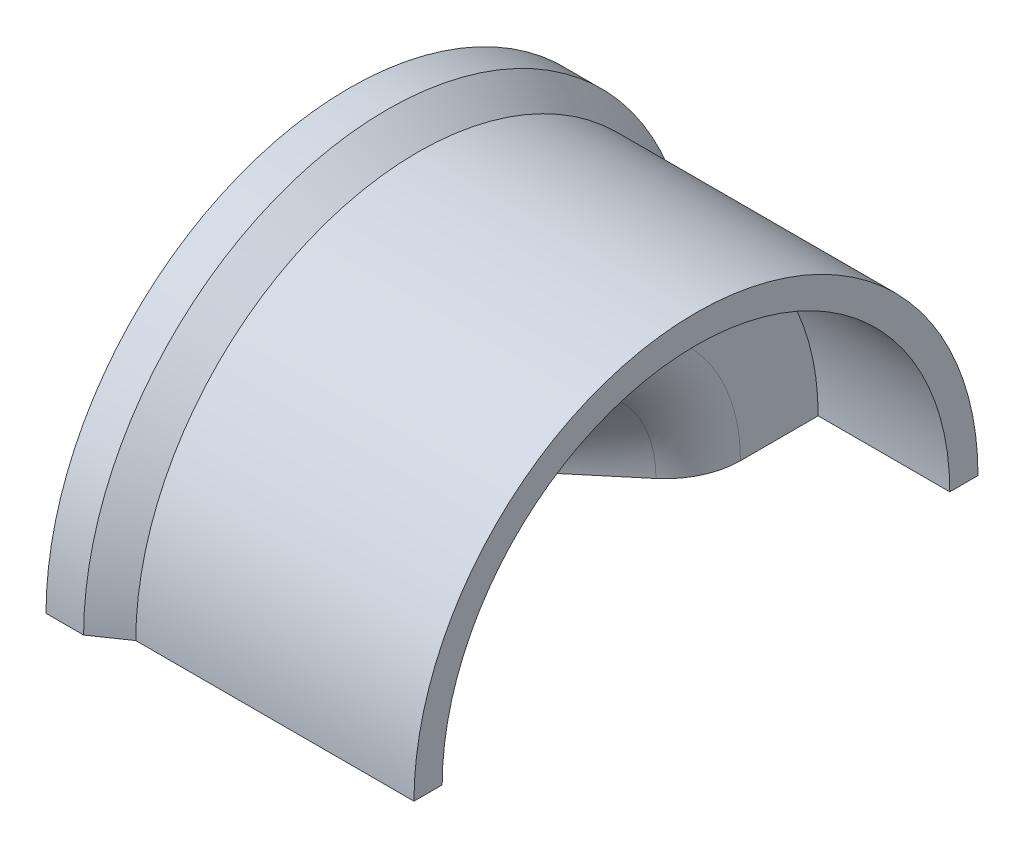
ISO-10303-21;
HEADER;
FILE_DESCRIPTION(('STEP AP214'),'2;1');
FILE_NAME('part.step','',(''),(''),'','','');
FILE_SCHEMA(('AUTOMOTIVE_DESIGN { 1 0 10303 214 1 1 1 1 }'));
ENDSEC;
DATA;
#1=APPLICATION_CONTEXT('core data for automotive mechanical design processes');
#2=APPLICATION_PROTOCOL_DEFINITION('international standard','automotive_design',2000,#1);
#3=PRODUCT_CONTEXT('',#1,'mechanical');
#4=PRODUCT('Part','Part','',(#3));
#5=PRODUCT_RELATED_PRODUCT_CATEGORY('part','',(#4));
#6=PRODUCT_DEFINITION_FORMATION('','',#4);
#7=PRODUCT_DEFINITION_CONTEXT('part definition',#1,'design');
#8=PRODUCT_DEFINITION('design','',#6,#7);
#9=PRODUCT_DEFINITION_SHAPE('','',#8);
#10=(LENGTH_UNIT() NAMED_UNIT(*) SI_UNIT(.MILLI.,.METRE.));
#11=(NAMED_UNIT(*) PLANE_ANGLE_UNIT() SI_UNIT($,.RADIAN.));
#12=(NAMED_UNIT(*) SI_UNIT($,.STERADIAN.) SOLID_ANGLE_UNIT());
#13=UNCERTAINTY_MEASURE_WITH_UNIT(LENGTH_MEASURE(1.E-05),#10,'distance_accuracy_value','');
#14=(GEOMETRIC_REPRESENTATION_CONTEXT(3) GLOBAL_UNCERTAINTY_ASSIGNED_CONTEXT((#13)) GLOBAL_UNIT_ASSIGNED_CONTEXT((#10,
#11,#12)) REPRESENTATION_CONTEXT('',''));
#15=CARTESIAN_POINT('',(0.,0.,0.));
#16=DIRECTION('',(0.,0.,1.));
#17=DIRECTION('',(1.,0.,0.));
#18=AXIS2_PLACEMENT_3D('',#15,#16,#17);
#19=CARTESIAN_POINT('',(31.9094287112631,0.,0.));
#20=DIRECTION('',(-1.,0.,0.));
#21=DIRECTION('',(0.,0.,1.));
#22=AXIS2_PLACEMENT_3D('',#19,#20,#21);
#23=CONICAL_SURFACE('',#22,13.9812828009221,0.602952512155745);
#24=CARTESIAN_POINT('',(24.5472437075883,0.,0.));
#25=DIRECTION('',(-1.,0.,0.));
#26=DIRECTION('',(0.,0.,1.));
#27=AXIS2_PLACEMENT_3D('',#24,#25,#26);
#28=CIRCLE('',#27,19.05);
#29=CARTESIAN_POINT('',(24.5472437075883,0.,-19.05));
#30=VERTEX_POINT('',#29);
#31=CARTESIAN_POINT('',(24.5472437075883,0.,19.05));
#32=VERTEX_POINT('',#31);
#33=EDGE_CURVE('E137',#30,#32,#28,.F.);
#34=ORIENTED_EDGE('',*,*,#33,.F.);
#35=DIRECTION('',(-0.823664906207426,0.,-0.567076822205168));
#36=VECTOR('',#35,1.);
#37=CARTESIAN_POINT('',(52.216892419795,0.,0.));
#38=LINE('',#37,#36);
#39=CARTESIAN_POINT('',(22.460516588814,0.,-20.4866699059361));
#40=VERTEX_POINT('',#39);
#41=EDGE_CURVE('E130',#30,#40,#38,.T.);
#42=ORIENTED_EDGE('',*,*,#41,.T.);
#43=CARTESIAN_POINT('',(22.460516588814,0.,0.));
#44=DIRECTION('',(-1.,0.,0.));
#45=DIRECTION('',(0.,0.,1.));
#46=AXIS2_PLACEMENT_3D('',#43,#44,#45);
#47=CIRCLE('',#46,20.4866699059361);
#48=CARTESIAN_POINT('',(22.460516588814,0.,20.4866699059361));
#49=VERTEX_POINT('',#48);
#50=EDGE_CURVE('E129',#49,#40,#47,.T.);
#51=ORIENTED_EDGE('',*,*,#50,.F.);
#52=DIRECTION('',(0.823664906207426,0.,-0.567076822205168));
#53=VECTOR('',#52,1.);
#54=CARTESIAN_POINT('',(52.216892419795,0.,0.));
#55=LINE('',#54,#53);
#56=EDGE_CURVE('E164',#49,#32,#55,.T.);
#57=ORIENTED_EDGE('',*,*,#56,.T.);
#58=EDGE_LOOP('',(#34,#42,#51,#57));
#59=FACE_BOUND('',#58,.T.);
#60=ADVANCED_FACE('F39',(#59),#23,.T.);
#61=CARTESIAN_POINT('',(28.575,0.,0.));
#62=DIRECTION('',(-1.,0.,0.));
#63=DIRECTION('',(0.,0.,1.));
#64=AXIS2_PLACEMENT_3D('',#61,#62,#63);
#65=CYLINDRICAL_SURFACE('',#64,20.4866699059361);
#66=ORIENTED_EDGE('',*,*,#50,.T.);
#67=DIRECTION('',(-1.,0.,0.));
#68=VECTOR('',#67,1.);
#69=CARTESIAN_POINT('',(28.575,0.,-20.4866699059361));
#70=LINE('',#69,#68);
#71=CARTESIAN_POINT('',(19.920516588814,0.,-20.4866699059361));
#72=VERTEX_POINT('',#71);
#73=EDGE_CURVE('E111',#40,#72,#70,.T.);
#74=ORIENTED_EDGE('',*,*,#73,.T.);
#75=CARTESIAN_POINT('',(19.920516588814,0.,0.));
#76=DIRECTION('',(-1.,0.,0.));
#77=DIRECTION('',(0.,0.,1.));
#78=AXIS2_PLACEMENT_3D('',#75,#76,#77);
#79=CIRCLE('',#78,20.4866699059361);
#80=CARTESIAN_POINT('',(19.920516588814,0.,20.4866699059361));
#81=VERTEX_POINT('',#80);
#82=EDGE_CURVE('E127',#81,#72,#79,.T.);
#83=ORIENTED_EDGE('',*,*,#82,.F.);
#84=DIRECTION('',(-1.,0.,0.));
#85=VECTOR('',#84,1.);
#86=CARTESIAN_POINT('',(28.575,0.,20.4866699059361));
#87=LINE('',#86,#85);
#88=EDGE_CURVE('E162',#81,#49,#87,.F.);
#89=ORIENTED_EDGE('',*,*,#88,.T.);
#90=EDGE_LOOP('',(#66,#74,#83,#89));
#91=FACE_BOUND('',#90,.T.);
#92=ADVANCED_FACE('F125',(#91),#65,.T.);
#93=CARTESIAN_POINT('',(0.,0.,0.));
#94=DIRECTION('',(-1.,0.,0.));
#95=DIRECTION('',(0.,0.,-1.));
#96=AXIS2_PLACEMENT_3D('',#93,#94,#95);
#97=SPHERICAL_SURFACE('',#96,28.575);
#98=ORIENTED_EDGE('',*,*,#82,.T.);
#99=CARTESIAN_POINT('',(0.,0.,0.));
#100=DIRECTION('',(0.,1.,0.));
#101=DIRECTION('',(0.,0.,1.));
#102=AXIS2_PLACEMENT_3D('',#99,#100,#101);
#103=CIRCLE('',#102,28.575);
#104=CARTESIAN_POINT('',(28.2465374065495,0.,-4.32015619398202));
#105=VERTEX_POINT('',#104);
#106=EDGE_CURVE('E108',#72,#105,#103,.F.);
#107=ORIENTED_EDGE('',*,*,#106,.T.);
#108=CARTESIAN_POINT('',(28.2465374065495,0.,0.));
#109=DIRECTION('',(-1.,0.,0.));
#110=DIRECTION('',(0.,0.,1.));
#111=AXIS2_PLACEMENT_3D('',#108,#109,#110);
#112=CIRCLE('',#111,4.32015619398202);
#113=CARTESIAN_POINT('',(28.2465374065495,0.,4.32015619398202));
#114=VERTEX_POINT('',#113);
#115=EDGE_CURVE('E146',#105,#114,#112,.F.);
#116=ORIENTED_EDGE('',*,*,#115,.T.);
#117=EDGE_CURVE('E121',#114,#81,#103,.F.);
#118=ORIENTED_EDGE('',*,*,#117,.T.);
#119=EDGE_LOOP('',(#98,#107,#116,#118));
#120=FACE_BOUND('',#119,.T.);
#121=ADVANCED_FACE('F133',(#120),#97,.F.);
#122=CARTESIAN_POINT('',(43.3394287112631,0.,0.));
#123=DIRECTION('',(1.,0.,0.));
#124=DIRECTION('',(0.,0.,-1.));
#125=AXIS2_PLACEMENT_3D('',#122,#123,#124);
#126=PLANE('',#125);
#127=DIRECTION('',(0.,0.,1.));
#128=VECTOR('',#127,1.);
#129=CARTESIAN_POINT('',(43.3394287112631,0.,0.));
#130=LINE('',#129,#128);
#131=CARTESIAN_POINT('',(43.3394287112631,0.,-19.05));
#132=VERTEX_POINT('',#131);
#133=CARTESIAN_POINT('',(43.3394287112631,0.,-17.145));
#134=VERTEX_POINT('',#133);
#135=EDGE_CURVE('E119',#132,#134,#130,.T.);
#136=ORIENTED_EDGE('',*,*,#135,.F.);
#137=CARTESIAN_POINT('',(43.3394287112631,0.,0.));
#138=DIRECTION('',(1.,0.,0.));
#139=DIRECTION('',(0.,0.,-1.));
#140=AXIS2_PLACEMENT_3D('',#137,#138,#139);
#141=CIRCLE('',#140,19.05);
#142=CARTESIAN_POINT('',(43.3394287112631,0.,19.05));
#143=VERTEX_POINT('',#142);
#144=EDGE_CURVE('E135',#132,#143,#141,.T.);
#145=ORIENTED_EDGE('',*,*,#144,.T.);
#146=CARTESIAN_POINT('',(43.3394287112631,0.,17.145));
#147=VERTEX_POINT('',#146);
#148=EDGE_CURVE('E163',#147,#143,#130,.T.);
#149=ORIENTED_EDGE('',*,*,#148,.F.);
#150=CARTESIAN_POINT('',(43.3394287112631,0.,0.));
#151=DIRECTION('',(1.,0.,0.));
#152=DIRECTION('',(0.,0.,-1.));
#153=AXIS2_PLACEMENT_3D('',#150,#151,#152);
#154=CIRCLE('',#153,17.145);
#155=EDGE_CURVE('E148',#134,#147,#154,.T.);
#156=ORIENTED_EDGE('',*,*,#155,.F.);
#157=EDGE_LOOP('',(#136,#145,#149,#156));
#158=FACE_BOUND('',#157,.T.);
#159=ADVANCED_FACE('F192',(#158),#126,.T.);
#160=CARTESIAN_POINT('',(43.3394287112631,0.,0.));
#161=DIRECTION('',(-1.,0.,0.));
#162=DIRECTION('',(0.,0.,1.));
#163=AXIS2_PLACEMENT_3D('',#160,#161,#162);
#164=CYLINDRICAL_SURFACE('',#163,19.05);
#165=ORIENTED_EDGE('',*,*,#144,.F.);
#166=DIRECTION('',(-1.,0.,0.));
#167=VECTOR('',#166,1.);
#168=CARTESIAN_POINT('',(43.3394287112631,0.,-19.05));
#169=LINE('',#168,#167);
#170=EDGE_CURVE('E171',#132,#30,#169,.T.);
#171=ORIENTED_EDGE('',*,*,#170,.T.);
#172=ORIENTED_EDGE('',*,*,#33,.T.);
#173=DIRECTION('',(-1.,0.,0.));
#174=VECTOR('',#173,1.);
#175=CARTESIAN_POINT('',(43.3394287112631,0.,19.05));
#176=LINE('',#175,#174);
#177=EDGE_CURVE('E149',#32,#143,#176,.F.);
#178=ORIENTED_EDGE('',*,*,#177,.T.);
#179=EDGE_LOOP('',(#165,#171,#172,#178));
#180=FACE_BOUND('',#179,.T.);
#181=ADVANCED_FACE('F195',(#180),#164,.T.);
#182=CARTESIAN_POINT('',(34.4494287112631,0.,0.));
#183=DIRECTION('',(1.,0.,0.));
#184=DIRECTION('',(0.,0.,-1.));
#185=AXIS2_PLACEMENT_3D('',#182,#183,#184);
#186=CYLINDRICAL_SURFACE('',#185,17.145);
#187=ORIENTED_EDGE('',*,*,#155,.T.);
#188=DIRECTION('',(1.,0.,0.));
#189=VECTOR('',#188,1.);
#190=CARTESIAN_POINT('',(34.4494287112631,0.,17.145));
#191=LINE('',#190,#189);
#192=CARTESIAN_POINT('',(34.4494287112631,0.,17.145));
#193=VERTEX_POINT('',#192);
#194=EDGE_CURVE('E166',#147,#193,#191,.F.);
#195=ORIENTED_EDGE('',*,*,#194,.T.);
#196=CARTESIAN_POINT('',(34.4494287112631,0.,0.));
#197=DIRECTION('',(1.,0.,0.));
#198=DIRECTION('',(0.,0.,-1.));
#199=AXIS2_PLACEMENT_3D('',#196,#197,#198);
#200=CIRCLE('',#199,17.145);
#201=CARTESIAN_POINT('',(34.4494287112631,0.,-17.145));
#202=VERTEX_POINT('',#201);
#203=EDGE_CURVE('E140',#202,#193,#200,.T.);
#204=ORIENTED_EDGE('',*,*,#203,.F.);
#205=DIRECTION('',(1.,0.,0.));
#206=VECTOR('',#205,1.);
#207=CARTESIAN_POINT('',(34.4494287112631,0.,-17.145));
#208=LINE('',#207,#206);
#209=EDGE_CURVE('E188',#202,#134,#208,.T.);
#210=ORIENTED_EDGE('',*,*,#209,.T.);
#211=EDGE_LOOP('',(#187,#195,#204,#210));
#212=FACE_BOUND('',#211,.T.);
#213=ADVANCED_FACE('F186',(#212),#186,.F.);
#214=CARTESIAN_POINT('',(34.4494287112631,0.,0.));
#215=DIRECTION('',(1.,0.,0.));
#216=DIRECTION('',(0.,0.,-1.));
#217=AXIS2_PLACEMENT_3D('',#214,#215,#216);
#218=PLANE('',#217);
#219=DIRECTION('',(0.,0.,1.));
#220=VECTOR('',#219,1.);
#221=CARTESIAN_POINT('',(34.4494287112631,0.,0.));
#222=LINE('',#221,#220);
#223=CARTESIAN_POINT('',(34.4494287112631,0.,11.8938429034274));
#224=VERTEX_POINT('',#223);
#225=EDGE_CURVE('E174',#224,#193,#222,.T.);
#226=ORIENTED_EDGE('',*,*,#225,.F.);
#227=CARTESIAN_POINT('',(34.4494287112631,0.,0.));
#228=DIRECTION('',(1.,0.,0.));
#229=DIRECTION('',(0.,0.,-1.));
#230=AXIS2_PLACEMENT_3D('',#227,#228,#229);
#231=CIRCLE('',#230,11.8938429034274);
#232=CARTESIAN_POINT('',(34.4494287112631,0.,-11.8938429034274));
#233=VERTEX_POINT('',#232);
#234=EDGE_CURVE('E47',#224,#233,#231,.F.);
#235=ORIENTED_EDGE('',*,*,#234,.T.);
#236=EDGE_CURVE('E198',#202,#233,#222,.T.);
#237=ORIENTED_EDGE('',*,*,#236,.F.);
#238=ORIENTED_EDGE('',*,*,#203,.T.);
#239=EDGE_LOOP('',(#226,#235,#237,#238));
#240=FACE_BOUND('',#239,.T.);
#241=ADVANCED_FACE('F200',(#240),#218,.T.);
#242=CARTESIAN_POINT('',(34.4494287112631,0.,0.));
#243=DIRECTION('',(1.,0.,0.));
#244=DIRECTION('',(0.,0.,-1.));
#245=AXIS2_PLACEMENT_3D('',#242,#243,#244);
#246=CONICAL_SURFACE('',#245,9.525,0.698131700797732);
#247=DIRECTION('',(-0.766044443118978,0.,0.64278760968654));
#248=VECTOR('',#247,1.);
#249=CARTESIAN_POINT('',(23.0979757418033,0.,0.));
#250=LINE('',#249,#248);
#251=CARTESIAN_POINT('',(32.6347897684707,0.,-8.00233713238299));
#252=VERTEX_POINT('',#251);
#253=EDGE_CURVE('E114',#105,#252,#250,.F.);
#254=ORIENTED_EDGE('',*,*,#253,.T.);
#255=CARTESIAN_POINT('',(32.6347897684707,0.,0.));
#256=DIRECTION('',(1.,0.,0.));
#257=DIRECTION('',(0.,0.,-1.));
#258=AXIS2_PLACEMENT_3D('',#255,#256,#257);
#259=CIRCLE('',#258,8.00233713238299);
#260=CARTESIAN_POINT('',(32.6347897684707,0.,8.00233713238299));
#261=VERTEX_POINT('',#260);
#262=EDGE_CURVE('E153',#252,#261,#259,.T.);
#263=ORIENTED_EDGE('',*,*,#262,.T.);
#264=DIRECTION('',(0.766044443118978,0.,0.64278760968654));
#265=VECTOR('',#264,1.);
#266=CARTESIAN_POINT('',(23.0979757418033,0.,0.));
#267=LINE('',#266,#265);
#268=EDGE_CURVE('E151',#261,#114,#267,.F.);
#269=ORIENTED_EDGE('',*,*,#268,.T.);
#270=ORIENTED_EDGE('',*,*,#115,.F.);
#271=EDGE_LOOP('',(#254,#263,#269,#270));
#272=FACE_BOUND('',#271,.T.);
#273=ADVANCED_FACE('F158',(#272),#246,.F.);
#274=CARTESIAN_POINT('',(19.920516588814,0.,21.6638681973403));
#275=DIRECTION('',(0.,1.,0.));
#276=DIRECTION('',(0.,0.,1.));
#277=AXIS2_PLACEMENT_3D('',#274,#275,#276);
#278=PLANE('',#277);
#279=ORIENTED_EDGE('',*,*,#236,.T.);
#280=CARTESIAN_POINT('',(29.3694287112631,0.,-11.8938429034274));
#281=DIRECTION('',(0.,1.,0.));
#282=DIRECTION('',(0.,0.,1.));
#283=AXIS2_PLACEMENT_3D('',#280,#281,#282);
#284=CIRCLE('',#283,5.08);
#285=EDGE_CURVE('E11',#233,#252,#284,.F.);
#286=ORIENTED_EDGE('',*,*,#285,.T.);
#287=ORIENTED_EDGE('',*,*,#253,.F.);
#288=ORIENTED_EDGE('',*,*,#106,.F.);
#289=ORIENTED_EDGE('',*,*,#73,.F.);
#290=ORIENTED_EDGE('',*,*,#41,.F.);
#291=ORIENTED_EDGE('',*,*,#170,.F.);
#292=ORIENTED_EDGE('',*,*,#135,.T.);
#293=ORIENTED_EDGE('',*,*,#209,.F.);
#294=EDGE_LOOP('',(#279,#286,#287,#288,#289,#290,#291,#292,#293));
#295=FACE_BOUND('',#294,.T.);
#296=ADVANCED_FACE('F110',(#295),#278,.F.);
#297=ORIENTED_EDGE('',*,*,#268,.F.);
#298=CARTESIAN_POINT('',(29.3694287112631,0.,11.8938429034274));
#299=DIRECTION('',(0.,1.,0.));
#300=DIRECTION('',(0.,0.,1.));
#301=AXIS2_PLACEMENT_3D('',#298,#299,#300);
#302=CIRCLE('',#301,5.08);
#303=EDGE_CURVE('E61',#261,#224,#302,.F.);
#304=ORIENTED_EDGE('',*,*,#303,.T.);
#305=ORIENTED_EDGE('',*,*,#225,.T.);
#306=ORIENTED_EDGE('',*,*,#194,.F.);
#307=ORIENTED_EDGE('',*,*,#148,.T.);
#308=ORIENTED_EDGE('',*,*,#177,.F.);
#309=ORIENTED_EDGE('',*,*,#56,.F.);
#310=ORIENTED_EDGE('',*,*,#88,.F.);
#311=ORIENTED_EDGE('',*,*,#117,.F.);
#312=EDGE_LOOP('',(#297,#304,#305,#306,#307,#308,#309,#310,#311));
#313=FACE_BOUND('',#312,.T.);
#314=ADVANCED_FACE('F161',(#313),#278,.F.);
#315=CARTESIAN_POINT('',(29.3694287112631,0.,0.));
#316=DIRECTION('',(1.,0.,0.));
#317=DIRECTION('',(0.,0.,-1.));
#318=AXIS2_PLACEMENT_3D('',#315,#316,#317);
#319=TOROIDAL_SURFACE('',#318,11.8938429034274,5.08);
#320=ORIENTED_EDGE('',*,*,#285,.F.);
#321=ORIENTED_EDGE('',*,*,#234,.F.);
#322=ORIENTED_EDGE('',*,*,#303,.F.);
#323=ORIENTED_EDGE('',*,*,#262,.F.);
#324=EDGE_LOOP('',(#320,#321,#322,#323));
#325=FACE_BOUND('',#324,.T.);
#326=ADVANCED_FACE('F41',(#325),#319,.T.);
#327=CLOSED_SHELL('',(#60,#92,#121,#159,#181,#213,#241,#273,#296,#314,#326));
#328=MANIFOLD_SOLID_BREP('B2',#327);
#329=ADVANCED_BREP_SHAPE_REPRESENTATION('',(#18,#328),#14);
#330=SHAPE_DEFINITION_REPRESENTATION(#9,#329);
ENDSEC;
END-ISO-10303-21;
